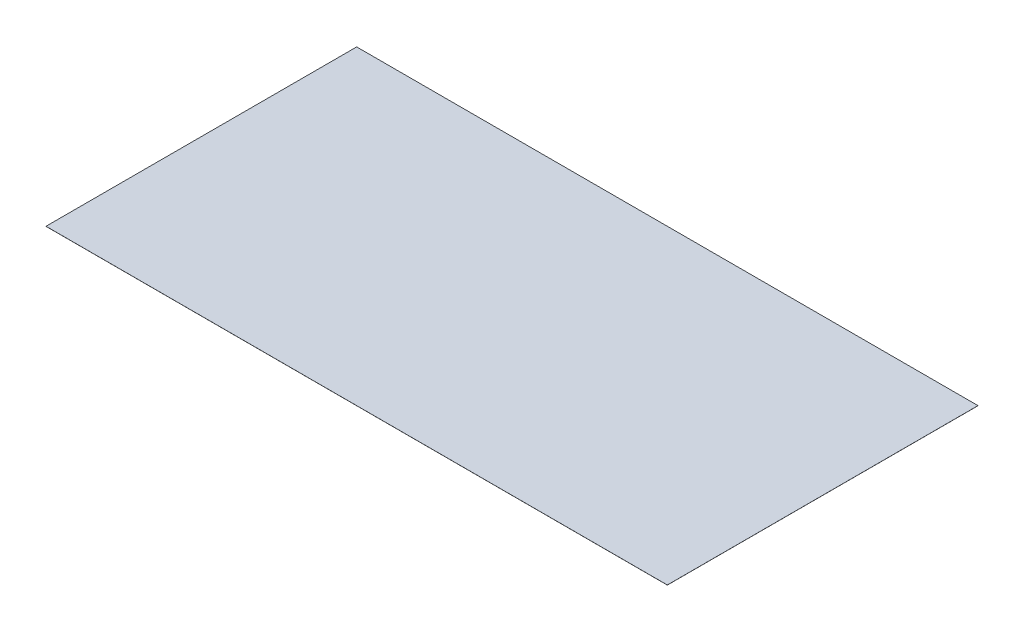
ISO-10303-21;
HEADER;
FILE_DESCRIPTION(('STEP AP214'),'2;1');
FILE_NAME('part.step','',(''),(''),'','','');
FILE_SCHEMA(('AUTOMOTIVE_DESIGN { 1 0 10303 214 1 1 1 1 }'));
ENDSEC;
DATA;
#1=APPLICATION_CONTEXT('core data for automotive mechanical design processes');
#2=APPLICATION_PROTOCOL_DEFINITION('international standard','automotive_design',2000,#1);
#3=PRODUCT_CONTEXT('',#1,'mechanical');
#4=PRODUCT('Part','Part','',(#3));
#5=PRODUCT_RELATED_PRODUCT_CATEGORY('part','',(#4));
#6=PRODUCT_DEFINITION_FORMATION('','',#4);
#7=PRODUCT_DEFINITION_CONTEXT('part definition',#1,'design');
#8=PRODUCT_DEFINITION('design','',#6,#7);
#9=PRODUCT_DEFINITION_SHAPE('','',#8);
#10=(LENGTH_UNIT() NAMED_UNIT(*) SI_UNIT(.MILLI.,.METRE.));
#11=(NAMED_UNIT(*) PLANE_ANGLE_UNIT() SI_UNIT($,.RADIAN.));
#12=(NAMED_UNIT(*) SI_UNIT($,.STERADIAN.) SOLID_ANGLE_UNIT());
#13=UNCERTAINTY_MEASURE_WITH_UNIT(LENGTH_MEASURE(1.E-05),#10,'distance_accuracy_value','');
#14=(GEOMETRIC_REPRESENTATION_CONTEXT(3) GLOBAL_UNCERTAINTY_ASSIGNED_CONTEXT((#13)) GLOBAL_UNIT_ASSIGNED_CONTEXT((#10,
#11,#12)) REPRESENTATION_CONTEXT('',''));
#15=CARTESIAN_POINT('',(0.,0.,0.));
#16=DIRECTION('',(0.,0.,1.));
#17=DIRECTION('',(1.,0.,0.));
#18=AXIS2_PLACEMENT_3D('',#15,#16,#17);
#19=CARTESIAN_POINT('',(0.,2.54,0.));
#20=DIRECTION('',(1.,0.,0.));
#21=DIRECTION('',(0.,0.,-1.));
#22=AXIS2_PLACEMENT_3D('',#19,#20,#21);
#23=PLANE('',#22);
#24=DIRECTION('',(0.,0.,1.));
#25=VECTOR('',#24,1.);
#26=CARTESIAN_POINT('',(0.,0.,0.));
#27=LINE('',#26,#25);
#28=CARTESIAN_POINT('',(0.,0.,-8229.6));
#29=VERTEX_POINT('',#28);
#30=CARTESIAN_POINT('',(0.,0.,0.));
#31=VERTEX_POINT('',#30);
#32=EDGE_CURVE('E96',#29,#31,#27,.T.);
#33=ORIENTED_EDGE('',*,*,#32,.T.);
#34=DIRECTION('',(0.,-1.,0.));
#35=VECTOR('',#34,1.);
#36=CARTESIAN_POINT('',(0.,2.54,0.));
#37=LINE('',#36,#35);
#38=CARTESIAN_POINT('',(0.,2.54,0.));
#39=VERTEX_POINT('',#38);
#40=EDGE_CURVE('E11',#39,#31,#37,.T.);
#41=ORIENTED_EDGE('',*,*,#40,.F.);
#42=DIRECTION('',(0.,0.,1.));
#43=VECTOR('',#42,1.);
#44=CARTESIAN_POINT('',(0.,2.54,0.));
#45=LINE('',#44,#43);
#46=CARTESIAN_POINT('',(0.,2.54,-8229.6));
#47=VERTEX_POINT('',#46);
#48=EDGE_CURVE('E84',#47,#39,#45,.T.);
#49=ORIENTED_EDGE('',*,*,#48,.F.);
#50=DIRECTION('',(0.,-1.,0.));
#51=VECTOR('',#50,1.);
#52=CARTESIAN_POINT('',(0.,2.54,-8229.6));
#53=LINE('',#52,#51);
#54=EDGE_CURVE('E92',#47,#29,#53,.T.);
#55=ORIENTED_EDGE('',*,*,#54,.T.);
#56=EDGE_LOOP('',(#33,#41,#49,#55));
#57=FACE_BOUND('',#56,.T.);
#58=ADVANCED_FACE('F33',(#57),#23,.F.);
#59=CARTESIAN_POINT('',(0.,2.54,0.));
#60=DIRECTION('',(0.,0.,-1.));
#61=DIRECTION('',(-1.,0.,0.));
#62=AXIS2_PLACEMENT_3D('',#59,#60,#61);
#63=PLANE('',#62);
#64=DIRECTION('',(1.,0.,0.));
#65=VECTOR('',#64,1.);
#66=CARTESIAN_POINT('',(0.,0.,0.));
#67=LINE('',#66,#65);
#68=CARTESIAN_POINT('',(16459.2,0.,0.));
#69=VERTEX_POINT('',#68);
#70=EDGE_CURVE('E88',#31,#69,#67,.T.);
#71=ORIENTED_EDGE('',*,*,#70,.T.);
#72=DIRECTION('',(0.,-1.,0.));
#73=VECTOR('',#72,1.);
#74=CARTESIAN_POINT('',(16459.2,2.54,0.));
#75=LINE('',#74,#73);
#76=CARTESIAN_POINT('',(16459.2,2.54,0.));
#77=VERTEX_POINT('',#76);
#78=EDGE_CURVE('E41',#77,#69,#75,.T.);
#79=ORIENTED_EDGE('',*,*,#78,.F.);
#80=DIRECTION('',(1.,0.,0.));
#81=VECTOR('',#80,1.);
#82=CARTESIAN_POINT('',(0.,2.54,0.));
#83=LINE('',#82,#81);
#84=EDGE_CURVE('E79',#39,#77,#83,.T.);
#85=ORIENTED_EDGE('',*,*,#84,.F.);
#86=ORIENTED_EDGE('',*,*,#40,.T.);
#87=EDGE_LOOP('',(#71,#79,#85,#86));
#88=FACE_BOUND('',#87,.T.);
#89=ADVANCED_FACE('F87',(#88),#63,.F.);
#90=CARTESIAN_POINT('',(16459.2,2.54,0.));
#91=DIRECTION('',(-1.,0.,0.));
#92=DIRECTION('',(0.,0.,1.));
#93=AXIS2_PLACEMENT_3D('',#90,#91,#92);
#94=PLANE('',#93);
#95=DIRECTION('',(0.,0.,-1.));
#96=VECTOR('',#95,1.);
#97=CARTESIAN_POINT('',(16459.2,0.,0.));
#98=LINE('',#97,#96);
#99=CARTESIAN_POINT('',(16459.2,0.,-8229.6));
#100=VERTEX_POINT('',#99);
#101=EDGE_CURVE('E66',#69,#100,#98,.T.);
#102=ORIENTED_EDGE('',*,*,#101,.T.);
#103=DIRECTION('',(0.,-1.,0.));
#104=VECTOR('',#103,1.);
#105=CARTESIAN_POINT('',(16459.2,2.54,-8229.6));
#106=LINE('',#105,#104);
#107=CARTESIAN_POINT('',(16459.2,2.54,-8229.6));
#108=VERTEX_POINT('',#107);
#109=EDGE_CURVE('E89',#108,#100,#106,.T.);
#110=ORIENTED_EDGE('',*,*,#109,.F.);
#111=DIRECTION('',(0.,0.,-1.));
#112=VECTOR('',#111,1.);
#113=CARTESIAN_POINT('',(16459.2,2.54,0.));
#114=LINE('',#113,#112);
#115=EDGE_CURVE('E82',#77,#108,#114,.T.);
#116=ORIENTED_EDGE('',*,*,#115,.F.);
#117=ORIENTED_EDGE('',*,*,#78,.T.);
#118=EDGE_LOOP('',(#102,#110,#116,#117));
#119=FACE_BOUND('',#118,.T.);
#120=ADVANCED_FACE('F90',(#119),#94,.F.);
#121=CARTESIAN_POINT('',(0.,2.54,-8229.6));
#122=DIRECTION('',(0.,0.,1.));
#123=DIRECTION('',(1.,0.,0.));
#124=AXIS2_PLACEMENT_3D('',#121,#122,#123);
#125=PLANE('',#124);
#126=DIRECTION('',(-1.,0.,0.));
#127=VECTOR('',#126,1.);
#128=CARTESIAN_POINT('',(0.,0.,-8229.6));
#129=LINE('',#128,#127);
#130=EDGE_CURVE('E72',#100,#29,#129,.T.);
#131=ORIENTED_EDGE('',*,*,#130,.T.);
#132=ORIENTED_EDGE('',*,*,#54,.F.);
#133=DIRECTION('',(-1.,0.,0.));
#134=VECTOR('',#133,1.);
#135=CARTESIAN_POINT('',(0.,2.54,-8229.6));
#136=LINE('',#135,#134);
#137=EDGE_CURVE('E49',#108,#47,#136,.T.);
#138=ORIENTED_EDGE('',*,*,#137,.F.);
#139=ORIENTED_EDGE('',*,*,#109,.T.);
#140=EDGE_LOOP('',(#131,#132,#138,#139));
#141=FACE_BOUND('',#140,.T.);
#142=ADVANCED_FACE('F103',(#141),#125,.F.);
#143=CARTESIAN_POINT('',(0.,2.54,0.));
#144=DIRECTION('',(0.,-1.,0.));
#145=DIRECTION('',(0.,0.,-1.));
#146=AXIS2_PLACEMENT_3D('',#143,#144,#145);
#147=PLANE('',#146);
#148=ORIENTED_EDGE('',*,*,#48,.T.);
#149=ORIENTED_EDGE('',*,*,#84,.T.);
#150=ORIENTED_EDGE('',*,*,#115,.T.);
#151=ORIENTED_EDGE('',*,*,#137,.T.);
#152=EDGE_LOOP('',(#148,#149,#150,#151));
#153=FACE_BOUND('',#152,.T.);
#154=ADVANCED_FACE('F80',(#153),#147,.F.);
#155=CARTESIAN_POINT('',(0.,0.,0.));
#156=DIRECTION('',(0.,-1.,0.));
#157=DIRECTION('',(0.,0.,-1.));
#158=AXIS2_PLACEMENT_3D('',#155,#156,#157);
#159=PLANE('',#158);
#160=ORIENTED_EDGE('',*,*,#32,.F.);
#161=ORIENTED_EDGE('',*,*,#130,.F.);
#162=ORIENTED_EDGE('',*,*,#101,.F.);
#163=ORIENTED_EDGE('',*,*,#70,.F.);
#164=EDGE_LOOP('',(#160,#161,#162,#163));
#165=FACE_BOUND('',#164,.T.);
#166=ADVANCED_FACE('F106',(#165),#159,.T.);
#167=CLOSED_SHELL('',(#58,#89,#120,#142,#154,#166));
#168=MANIFOLD_SOLID_BREP('B2',#167);
#169=ADVANCED_BREP_SHAPE_REPRESENTATION('',(#18,#168),#14);
#170=SHAPE_DEFINITION_REPRESENTATION(#9,#169);
ENDSEC;
END-ISO-10303-21;
